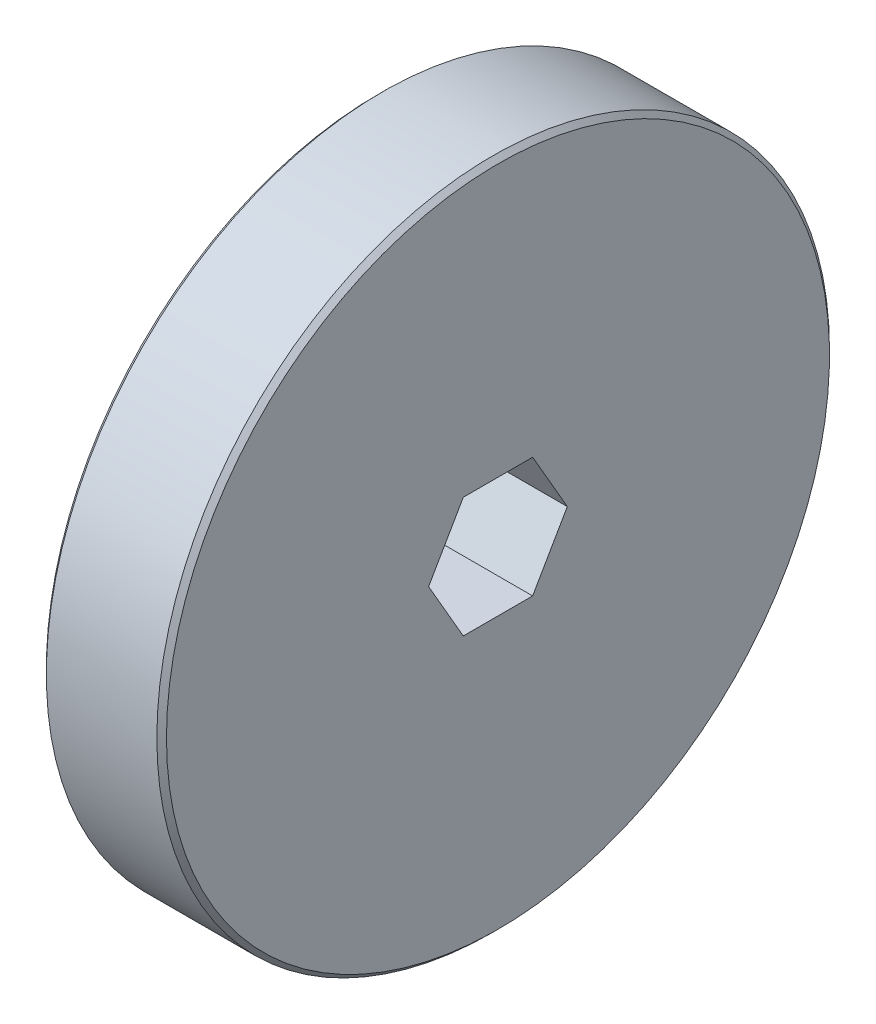
ISO-10303-21;
HEADER;
FILE_DESCRIPTION(('STEP AP214'),'2;1');
FILE_NAME('part.step','',(''),(''),'','','');
FILE_SCHEMA(('AUTOMOTIVE_DESIGN { 1 0 10303 214 1 1 1 1 }'));
ENDSEC;
DATA;
#1=APPLICATION_CONTEXT('core data for automotive mechanical design processes');
#2=APPLICATION_PROTOCOL_DEFINITION('international standard','automotive_design',2000,#1);
#3=PRODUCT_CONTEXT('',#1,'mechanical');
#4=PRODUCT('Part','Part','',(#3));
#5=PRODUCT_RELATED_PRODUCT_CATEGORY('part','',(#4));
#6=PRODUCT_DEFINITION_FORMATION('','',#4);
#7=PRODUCT_DEFINITION_CONTEXT('part definition',#1,'design');
#8=PRODUCT_DEFINITION('design','',#6,#7);
#9=PRODUCT_DEFINITION_SHAPE('','',#8);
#10=(LENGTH_UNIT() NAMED_UNIT(*) SI_UNIT(.MILLI.,.METRE.));
#11=(NAMED_UNIT(*) PLANE_ANGLE_UNIT() SI_UNIT($,.RADIAN.));
#12=(NAMED_UNIT(*) SI_UNIT($,.STERADIAN.) SOLID_ANGLE_UNIT());
#13=UNCERTAINTY_MEASURE_WITH_UNIT(LENGTH_MEASURE(1.E-05),#10,'distance_accuracy_value','');
#14=(GEOMETRIC_REPRESENTATION_CONTEXT(3) GLOBAL_UNCERTAINTY_ASSIGNED_CONTEXT((#13)) GLOBAL_UNIT_ASSIGNED_CONTEXT((#10,
#11,#12)) REPRESENTATION_CONTEXT('',''));
#15=CARTESIAN_POINT('',(0.,0.,0.));
#16=DIRECTION('',(0.,0.,1.));
#17=DIRECTION('',(1.,0.,0.));
#18=AXIS2_PLACEMENT_3D('',#15,#16,#17);
#19=CARTESIAN_POINT('',(837.258566213659,214.232644835281,0.));
#20=DIRECTION('',(1.,0.,0.));
#21=DIRECTION('',(0.,1.,0.));
#22=AXIS2_PLACEMENT_3D('',#19,#20,#21);
#23=TOROIDAL_SURFACE('',#22,8.19150000000003,0.253999999999916);
#24=CARTESIAN_POINT('',(837.512566213659,214.232644835281,0.));
#25=DIRECTION('',(1.,0.,0.));
#26=DIRECTION('',(0.,1.,0.));
#27=AXIS2_PLACEMENT_3D('',#24,#25,#26);
#28=CIRCLE('',#27,8.19149999999999);
#29=CARTESIAN_POINT('',(837.512566213659,222.424144835281,0.));
#30=VERTEX_POINT('',#29);
#31=EDGE_CURVE('E20',#30,#30,#28,.T.);
#32=ORIENTED_EDGE('',*,*,#31,.F.);
#33=EDGE_LOOP('',(#32));
#34=FACE_BOUND('',#33,.T.);
#35=CARTESIAN_POINT('',(837.258566213659,214.232644835281,0.));
#36=DIRECTION('',(1.,0.,0.));
#37=DIRECTION('',(0.,0.,-1.));
#38=AXIS2_PLACEMENT_3D('',#35,#36,#37);
#39=CIRCLE('',#38,7.9375);
#40=CARTESIAN_POINT('',(837.258566213659,214.232644835281,-7.9375));
#41=VERTEX_POINT('',#40);
#42=EDGE_CURVE('E156',#41,#41,#39,.F.);
#43=ORIENTED_EDGE('',*,*,#42,.F.);
#44=EDGE_LOOP('',(#43));
#45=FACE_BOUND('',#44,.T.);
#46=ADVANCED_FACE('F17',(#34,#45),#23,.F.);
#47=CARTESIAN_POINT('',(837.195066213659,214.232644835281,0.));
#48=DIRECTION('',(1.,0.,0.));
#49=DIRECTION('',(0.,0.,-1.));
#50=AXIS2_PLACEMENT_3D('',#47,#48,#49);
#51=CYLINDRICAL_SURFACE('',#50,7.9375);
#52=ORIENTED_EDGE('',*,*,#42,.T.);
#53=EDGE_LOOP('',(#52));
#54=FACE_BOUND('',#53,.T.);
#55=CARTESIAN_POINT('',(837.131566213773,214.232644835281,0.));
#56=DIRECTION('',(1.,0.,0.));
#57=DIRECTION('',(0.,-1.,0.));
#58=AXIS2_PLACEMENT_3D('',#55,#56,#57);
#59=CIRCLE('',#58,7.93749999988619);
#60=CARTESIAN_POINT('',(837.131566213773,206.295144835395,0.));
#61=VERTEX_POINT('',#60);
#62=EDGE_CURVE('E150',#61,#61,#59,.F.);
#63=ORIENTED_EDGE('',*,*,#62,.F.);
#64=EDGE_LOOP('',(#63));
#65=FACE_BOUND('',#64,.T.);
#66=ADVANCED_FACE('F335',(#54,#65),#51,.T.);
#67=CARTESIAN_POINT('',(837.512566213659,231.536394835281,0.));
#68=DIRECTION('',(-1.,0.,0.));
#69=DIRECTION('',(0.,0.,1.));
#70=AXIS2_PLACEMENT_3D('',#67,#68,#69);
#71=PLANE('',#70);
#72=ORIENTED_EDGE('',*,*,#31,.T.);
#73=EDGE_LOOP('',(#72));
#74=FACE_BOUND('',#73,.T.);
#75=CARTESIAN_POINT('',(837.512566213488,214.232644835281,0.));
#76=DIRECTION('',(1.,0.,0.));
#77=DIRECTION('',(0.,0.,-1.));
#78=AXIS2_PLACEMENT_3D('',#75,#76,#77);
#79=CIRCLE('',#78,26.289000000171);
#80=CARTESIAN_POINT('',(837.512566213488,214.232644835281,-26.289000000171));
#81=VERTEX_POINT('',#80);
#82=EDGE_CURVE('E153',#81,#81,#79,.T.);
#83=ORIENTED_EDGE('',*,*,#82,.F.);
#84=EDGE_LOOP('',(#83));
#85=FACE_BOUND('',#84,.T.);
#86=ADVANCED_FACE('F326',(#74,#85),#71,.T.);
#87=CARTESIAN_POINT('',(837.131566213773,214.232644835281,0.));
#88=DIRECTION('',(1.,0.,0.));
#89=DIRECTION('',(0.,0.,-1.));
#90=AXIS2_PLACEMENT_3D('',#87,#88,#89);
#91=CONICAL_SURFACE('',#90,7.93749999988616,0.785398162499982);
#92=ORIENTED_EDGE('',*,*,#62,.T.);
#93=EDGE_LOOP('',(#92));
#94=FACE_BOUND('',#93,.T.);
#95=CARTESIAN_POINT('',(836.877566213545,214.232644835281,0.));
#96=DIRECTION('',(1.,0.,0.));
#97=DIRECTION('',(0.,0.,-1.));
#98=AXIS2_PLACEMENT_3D('',#95,#96,#97);
#99=CIRCLE('',#98,7.68350000011406);
#100=CARTESIAN_POINT('',(836.877566213545,214.232644835281,-7.68350000011406));
#101=VERTEX_POINT('',#100);
#102=EDGE_CURVE('E147',#101,#101,#99,.F.);
#103=ORIENTED_EDGE('',*,*,#102,.F.);
#104=EDGE_LOOP('',(#103));
#105=FACE_BOUND('',#104,.T.);
#106=ADVANCED_FACE('F317',(#94,#105),#91,.T.);
#107=CARTESIAN_POINT('',(837.89356621383,214.232644835281,0.));
#108=DIRECTION('',(1.,0.,0.));
#109=DIRECTION('',(0.,0.,-1.));
#110=AXIS2_PLACEMENT_3D('',#107,#108,#109);
#111=CONICAL_SURFACE('',#110,26.6699999998291,0.785398162499945);
#112=CARTESIAN_POINT('',(837.893566213659,214.232644835281,0.));
#113=DIRECTION('',(1.,0.,0.));
#114=DIRECTION('',(0.,0.,-1.));
#115=AXIS2_PLACEMENT_3D('',#112,#113,#114);
#116=CIRCLE('',#115,26.67);
#117=CARTESIAN_POINT('',(837.893566213659,214.232644835281,-26.67));
#118=VERTEX_POINT('',#117);
#119=EDGE_CURVE('E144',#118,#118,#116,.T.);
#120=ORIENTED_EDGE('',*,*,#119,.F.);
#121=EDGE_LOOP('',(#120));
#122=FACE_BOUND('',#121,.T.);
#123=ORIENTED_EDGE('',*,*,#82,.T.);
#124=EDGE_LOOP('',(#123));
#125=FACE_BOUND('',#124,.T.);
#126=ADVANCED_FACE('F308',(#122,#125),#111,.T.);
#127=CARTESIAN_POINT('',(836.877566213659,218.201394835281,0.));
#128=DIRECTION('',(-1.,0.,0.));
#129=DIRECTION('',(0.,0.,1.));
#130=AXIS2_PLACEMENT_3D('',#127,#128,#129);
#131=PLANE('',#130);
#132=CARTESIAN_POINT('',(836.877566213218,214.232644835281,0.));
#133=DIRECTION('',(-1.,0.,0.));
#134=DIRECTION('',(0.,0.,1.));
#135=AXIS2_PLACEMENT_3D('',#132,#133,#134);
#136=CIRCLE('',#135,5.7784999995894);
#137=CARTESIAN_POINT('',(836.877566213218,214.232644835281,5.7784999995894));
#138=VERTEX_POINT('',#137);
#139=EDGE_CURVE('E116',#138,#138,#136,.F.);
#140=ORIENTED_EDGE('',*,*,#139,.T.);
#141=EDGE_LOOP('',(#140));
#142=FACE_BOUND('',#141,.T.);
#143=ORIENTED_EDGE('',*,*,#102,.T.);
#144=EDGE_LOOP('',(#143));
#145=FACE_BOUND('',#144,.T.);
#146=ADVANCED_FACE('F300',(#142,#145),#131,.T.);
#147=CARTESIAN_POINT('',(842.275066213659,214.232644835281,0.));
#148=DIRECTION('',(1.,0.,0.));
#149=DIRECTION('',(0.,0.,-1.));
#150=AXIS2_PLACEMENT_3D('',#147,#148,#149);
#151=CYLINDRICAL_SURFACE('',#150,26.67);
#152=CARTESIAN_POINT('',(846.656566213488,214.232644835281,0.));
#153=DIRECTION('',(-1.,0.,0.));
#154=DIRECTION('',(0.,-1.,0.));
#155=AXIS2_PLACEMENT_3D('',#152,#153,#154);
#156=CIRCLE('',#155,26.6699999998289);
#157=CARTESIAN_POINT('',(846.656566213488,187.562644835452,0.));
#158=VERTEX_POINT('',#157);
#159=EDGE_CURVE('E83',#158,#158,#156,.F.);
#160=ORIENTED_EDGE('',*,*,#159,.F.);
#161=EDGE_LOOP('',(#160));
#162=FACE_BOUND('',#161,.T.);
#163=ORIENTED_EDGE('',*,*,#119,.T.);
#164=EDGE_LOOP('',(#163));
#165=FACE_BOUND('',#164,.T.);
#166=ADVANCED_FACE('F222',(#162,#165),#151,.T.);
#167=CARTESIAN_POINT('',(836.877566213332,214.232644835281,0.));
#168=DIRECTION('',(-1.,0.,0.));
#169=DIRECTION('',(0.,0.,1.));
#170=AXIS2_PLACEMENT_3D('',#167,#168,#169);
#171=CONICAL_SURFACE('',#170,5.77849999947572,0.785398162479808);
#172=ORIENTED_EDGE('',*,*,#139,.F.);
#173=EDGE_LOOP('',(#172));
#174=FACE_BOUND('',#173,.T.);
#175=CARTESIAN_POINT('',(837.156804899375,214.23264483515,5.4992613140049));
#176=CARTESIAN_POINT('',(837.203764506173,214.151296721603,5.45229495871926));
#177=CARTESIAN_POINT('',(837.249292121181,214.069327036238,5.4049697387953));
#178=CARTESIAN_POINT('',(837.337051412476,213.904023698699,5.30953181235902));
#179=CARTESIAN_POINT('',(837.379281294079,213.820689333274,5.26141869405156));
#180=CARTESIAN_POINT('',(837.50078464314,213.567584214509,5.1152883856044));
#181=CARTESIAN_POINT('',(837.574297836866,213.395684363853,5.01604196055245));
#182=CARTESIAN_POINT('',(837.701197168666,213.046877274866,4.81465809382796));
#183=CARTESIAN_POINT('',(837.754651424902,212.869989217626,4.71253172636323));
#184=CARTESIAN_POINT('',(837.816446435017,212.601772060353,4.55767647841306));
#185=CARTESIAN_POINT('',(837.833970031529,212.511998147044,4.50584548539932));
#186=CARTESIAN_POINT('',(837.862490403619,212.331686866309,4.4017427189247));
#187=CARTESIAN_POINT('',(837.873489349348,212.241149762899,4.34947109789359));
#188=CARTESIAN_POINT('',(837.885222586719,212.100644053655,4.26835008885097));
#189=CARTESIAN_POINT('',(837.888349230901,212.050817576387,4.23958275879582));
#190=CARTESIAN_POINT('',(837.892521445237,211.951127913255,4.18202690492638));
#191=CARTESIAN_POINT('',(837.893568145892,211.901264762076,4.15323840113767));
#192=CARTESIAN_POINT('',(837.893561367614,211.726231122484,4.05218268214806));
#193=CARTESIAN_POINT('',(837.886951069542,211.601024729453,3.97989473749983));
#194=CARTESIAN_POINT('',(837.860872150104,211.351572110559,3.83587320088448));
#195=CARTESIAN_POINT('',(837.841394560357,211.227326615584,3.76414003089556));
#196=CARTESIAN_POINT('',(837.790496761624,210.980109402702,3.62140910647534));
#197=CARTESIAN_POINT('',(837.759021632719,210.857146254712,3.55041629988838));
#198=CARTESIAN_POINT('',(837.685567559506,210.613584185982,3.4097956739465));
#199=CARTESIAN_POINT('',(837.643584562668,210.492986196799,3.34016839242643));
#200=CARTESIAN_POINT('',(837.536481927183,210.217975457053,3.18139086780315));
#201=CARTESIAN_POINT('',(837.468212112531,210.064484316596,3.09277271654229));
#202=CARTESIAN_POINT('',(837.357151111582,209.838332372995,2.96220383102676));
#203=CARTESIAN_POINT('',(837.318880861494,209.763957313138,2.91926337019752));
#204=CARTESIAN_POINT('',(837.239725108844,209.616271808842,2.8339971045368));
#205=CARTESIAN_POINT('',(837.198840041688,209.542961189639,2.7916711988056));
#206=CARTESIAN_POINT('',(837.156804899355,209.470144835397,2.74963065708219));
#207=B_SPLINE_CURVE_WITH_KNOTS('',3,(#175,#176,#177,#178,#179,#180,#181,#182,#183,#184,#185,
#186,#187,#188,#189,#190,#191,#192,#193,#194,#195,#196,#197,#198,#199,#200,#201,#202,#203,#204,
#205,#206),.UNSPECIFIED.,.F.,.F.,(4,2,2,2,2,2,2,2,2,2,2,2,2,2,2,4),(0.,0.315033356543265,
0.630236981871507,1.26441953449715,1.89642854619521,2.21165534616572,2.52677724035208,
2.69960160991942,2.87233201940279,3.30585139208471,3.73967324288936,4.17550527968456,
4.61150566187489,5.18066674363257,5.46270108836043,5.74468859184734),.UNSPECIFIED.);
#208=CARTESIAN_POINT('',(837.156804899357,214.232644835281,5.4992613139633));
#209=VERTEX_POINT('',#208);
#210=CARTESIAN_POINT('',(837.156804899357,209.47014483534,2.74963065698166));
#211=VERTEX_POINT('',#210);
#212=EDGE_CURVE('E90',#209,#211,#207,.T.);
#213=ORIENTED_EDGE('',*,*,#212,.T.);
#214=CARTESIAN_POINT('',(837.156804899375,209.470144835239,2.74963065688916));
#215=CARTESIAN_POINT('',(837.203764506173,209.470144835266,2.65569794636446));
#216=CARTESIAN_POINT('',(837.249292121181,209.470144835277,2.56104750653634));
#217=CARTESIAN_POINT('',(837.337051412476,209.470144835286,2.37017165367875));
#218=CARTESIAN_POINT('',(837.379281294079,209.470144835283,2.273945417059));
#219=CARTESIAN_POINT('',(837.50078464314,209.470144835278,1.98168480015664));
#220=CARTESIAN_POINT('',(837.574297836866,209.47014483528,1.78319195005615));
#221=CARTESIAN_POINT('',(837.701197168666,209.470144835282,1.38042421661107));
#222=CARTESIAN_POINT('',(837.754651424902,209.470144835283,1.17617148168209));
#223=CARTESIAN_POINT('',(837.816446435017,209.470144835281,0.866460985778095));
#224=CARTESIAN_POINT('',(837.833970031529,209.470144835279,0.762798999748665));
#225=CARTESIAN_POINT('',(837.862490403619,209.470144835283,0.554593466805791));
#226=CARTESIAN_POINT('',(837.873489349348,209.470144835288,0.450050224751869));
#227=CARTESIAN_POINT('',(837.885222586719,209.470144835278,0.287808206648838));
#228=CARTESIAN_POINT('',(837.888349230901,209.470144835271,0.230273546526256));
#229=CARTESIAN_POINT('',(837.892521445237,209.470144835292,0.11516183882451));
#230=CARTESIAN_POINT('',(837.893568145892,209.47014483532,0.0575848312964613));
#231=CARTESIAN_POINT('',(837.893561367614,209.470144835367,-0.144526606602171));
#232=CARTESIAN_POINT('',(837.886951069542,209.470144835304,-0.289102496007333));
#233=CARTESIAN_POINT('',(837.860872150104,209.470144835258,-0.577145569317661));
#234=CARTESIAN_POINT('',(837.841394560357,209.470144835275,-0.720611909266349));
#235=CARTESIAN_POINT('',(837.790496761624,209.470144835287,-1.00607375808534));
#236=CARTESIAN_POINT('',(837.759021632719,209.470144835283,-1.14805937126713));
#237=CARTESIAN_POINT('',(837.685567559506,209.47014483528,-1.4293006231567));
#238=CARTESIAN_POINT('',(837.643584562668,209.470144835281,-1.56855518619481));
#239=CARTESIAN_POINT('',(837.536481927183,209.470144835282,-1.88611023543937));
#240=CARTESIAN_POINT('',(837.468212112531,209.470144835281,-2.06334653796198));
#241=CARTESIAN_POINT('',(837.357151111582,209.470144835281,-2.32448430899338));
#242=CARTESIAN_POINT('',(837.318880861494,209.470144835281,-2.41036523065183));
#243=CARTESIAN_POINT('',(837.239725108844,209.470144835281,-2.58089776197315));
#244=CARTESIAN_POINT('',(837.198840041688,209.470144835281,-2.6655495734355));
#245=CARTESIAN_POINT('',(837.156804899355,209.470144835281,-2.74963065688241));
#246=B_SPLINE_CURVE_WITH_KNOTS('',3,(#214,#215,#216,#217,#218,#219,#220,#221,#222,#223,#224,
#225,#226,#227,#228,#229,#230,#231,#232,#233,#234,#235,#236,#237,#238,#239,#240,#241,#242,#243,
#244,#245),.UNSPECIFIED.,.F.,.F.,(4,2,2,2,2,2,2,2,2,2,2,2,2,2,2,4),(0.,0.315033356543268,
0.630236981871517,1.26441953449716,1.89642854619521,2.21165534616574,2.52677724035209,
2.69960160991944,2.87233201940281,3.30585139208471,3.73967324288935,4.17550527968455,
4.6115056618749,5.18066674363258,5.46270108836044,5.74468859184735),.UNSPECIFIED.);
#247=CARTESIAN_POINT('',(837.156804899357,209.47014483534,-2.74963065698164));
#248=VERTEX_POINT('',#247);
#249=EDGE_CURVE('E102',#211,#248,#246,.T.);
#250=ORIENTED_EDGE('',*,*,#249,.T.);
#251=CARTESIAN_POINT('',(837.156804899375,209.470144835369,-2.74963065711573));
#252=CARTESIAN_POINT('',(837.203764506173,209.551492948944,-2.79659701235479));
#253=CARTESIAN_POINT('',(837.249292121181,209.63346263432,-2.84392223225896));
#254=CARTESIAN_POINT('',(837.337051412476,209.798765971868,-2.93936015868027));
#255=CARTESIAN_POINT('',(837.379281294079,209.88210033729,-2.98747327699256));
#256=CARTESIAN_POINT('',(837.50078464314,210.135205456051,-3.13360358544776));
#257=CARTESIAN_POINT('',(837.574297836866,210.307105306708,-3.2328500104963));
#258=CARTESIAN_POINT('',(837.701197168666,210.655912395697,-3.43423387721689));
#259=CARTESIAN_POINT('',(837.754651424902,210.832800452939,-3.53636024468113));
#260=CARTESIAN_POINT('',(837.816446435017,211.101017610209,-3.69121549263496));
#261=CARTESIAN_POINT('',(837.833970031529,211.190791523517,-3.74304648565065));
#262=CARTESIAN_POINT('',(837.862490403619,211.371102804256,-3.8471492521189));
#263=CARTESIAN_POINT('',(837.873489349348,211.461639907671,-3.89942087314171));
#264=CARTESIAN_POINT('',(837.885222586719,211.602145616904,-3.98054188220212));
#265=CARTESIAN_POINT('',(837.888349230901,211.651972094165,-4.00930921226954));
#266=CARTESIAN_POINT('',(837.892521445237,211.751661757318,-4.06686506610186));
#267=CARTESIAN_POINT('',(837.893568145892,211.801524908526,-4.09565356984121));
#268=CARTESIAN_POINT('',(837.893561367614,211.976558548164,-4.19670928875024));
#269=CARTESIAN_POINT('',(837.886951069542,212.101764941133,-4.26899723350717));
#270=CARTESIAN_POINT('',(837.860872150104,212.351217559981,-4.41301877020217));
#271=CARTESIAN_POINT('',(837.841394560357,212.475463054973,-4.48475194016194));
#272=CARTESIAN_POINT('',(837.790496761624,212.722680267867,-4.62748286456072));
#273=CARTESIAN_POINT('',(837.759021632719,212.845643415852,-4.69847567115553));
#274=CARTESIAN_POINT('',(837.685567559506,213.089205484579,-4.83909629710322));
#275=CARTESIAN_POINT('',(837.643584562668,213.209803473764,-4.90872357862125));
#276=CARTESIAN_POINT('',(837.536481927183,213.48481421351,-5.06750110324253));
#277=CARTESIAN_POINT('',(837.468212112531,213.638305353967,-5.15611925450427));
#278=CARTESIAN_POINT('',(837.357151111582,213.864457297568,-5.28668814002015));
#279=CARTESIAN_POINT('',(837.318880861494,213.938832357425,-5.32962860084935));
#280=CARTESIAN_POINT('',(837.239725108844,214.08651786172,-5.41489486650996));
#281=CARTESIAN_POINT('',(837.198840041688,214.159828480923,-5.4572207722411));
#282=CARTESIAN_POINT('',(837.156804899355,214.232644835166,-5.4992613139646));
#283=B_SPLINE_CURVE_WITH_KNOTS('',3,(#251,#252,#253,#254,#255,#256,#257,#258,#259,#260,#261,
#262,#263,#264,#265,#266,#267,#268,#269,#270,#271,#272,#273,#274,#275,#276,#277,#278,#279,#280,
#281,#282),.UNSPECIFIED.,.F.,.F.,(4,2,2,2,2,2,2,2,2,2,2,2,2,2,2,4),(0.,0.315033356543281,
0.630236981871528,1.26441953449719,1.89642854619526,2.21165534616574,2.5267772403521,
2.69960160991944,2.87233201940286,3.30585139208479,3.73967324288941,4.17550527968462,
4.61150566187497,5.1806667436326,5.46270108836049,5.74468859184737),.UNSPECIFIED.);
#284=CARTESIAN_POINT('',(837.156804899357,214.232644835281,-5.4992613139633));
#285=VERTEX_POINT('',#284);
#286=EDGE_CURVE('E107',#248,#285,#283,.T.);
#287=ORIENTED_EDGE('',*,*,#286,.T.);
#288=CARTESIAN_POINT('',(837.156804899375,214.232644835412,-5.4992613140049));
#289=CARTESIAN_POINT('',(837.203764506173,214.313992948959,-5.45229495871926));
#290=CARTESIAN_POINT('',(837.249292121181,214.395962634324,-5.40496973879529));
#291=CARTESIAN_POINT('',(837.337051412476,214.561265971864,-5.30953181235901));
#292=CARTESIAN_POINT('',(837.379281294079,214.644600337288,-5.26141869405156));
#293=CARTESIAN_POINT('',(837.50078464314,214.897705456054,-5.11528838560439));
#294=CARTESIAN_POINT('',(837.574297836866,215.069605306709,-5.01604196055244));
#295=CARTESIAN_POINT('',(837.701197168666,215.418412395696,-4.81465809382795));
#296=CARTESIAN_POINT('',(837.754651424902,215.595300452937,-4.71253172636322));
#297=CARTESIAN_POINT('',(837.816446435017,215.86351761021,-4.55767647841306));
#298=CARTESIAN_POINT('',(837.833970031529,215.953291523519,-4.50584548539932));
#299=CARTESIAN_POINT('',(837.862490403619,216.133602804254,-4.4017427189247));
#300=CARTESIAN_POINT('',(837.873489349348,216.224139907664,-4.34947109789359));
#301=CARTESIAN_POINT('',(837.885222586719,216.364645616908,-4.26835008885097));
#302=CARTESIAN_POINT('',(837.888349230901,216.414472094175,-4.23958275879582));
#303=CARTESIAN_POINT('',(837.892521445237,216.514161757307,-4.18202690492638));
#304=CARTESIAN_POINT('',(837.893568145892,216.564024908486,-4.15323840113767));
#305=CARTESIAN_POINT('',(837.893561367614,216.739058548079,-4.05218268214807));
#306=CARTESIAN_POINT('',(837.886951069542,216.86426494111,-3.97989473749981));
#307=CARTESIAN_POINT('',(837.860872150104,217.113717560004,-3.83587320088445));
#308=CARTESIAN_POINT('',(837.841394560357,217.237963054979,-3.76414003089553));
#309=CARTESIAN_POINT('',(837.790496761624,217.485180267861,-3.62140910647532));
#310=CARTESIAN_POINT('',(837.759021632719,217.608143415851,-3.55041629988836));
#311=CARTESIAN_POINT('',(837.685567559506,217.851705484581,-3.40979567394648));
#312=CARTESIAN_POINT('',(837.643584562668,217.972303473764,-3.3401683924264));
#313=CARTESIAN_POINT('',(837.536481927183,218.247314213509,-3.18139086780314));
#314=CARTESIAN_POINT('',(837.468212112531,218.400805353967,-3.09277271654229));
#315=CARTESIAN_POINT('',(837.357151111582,218.626957297568,-2.96220383102674));
#316=CARTESIAN_POINT('',(837.318880861494,218.701332357425,-2.91926337019748));
#317=CARTESIAN_POINT('',(837.239725108844,218.84901786172,-2.83399710453676));
#318=CARTESIAN_POINT('',(837.198840041688,218.922328480923,-2.79167119880556));
#319=CARTESIAN_POINT('',(837.156804899355,218.995144835166,-2.74963065708218));
#320=B_SPLINE_CURVE_WITH_KNOTS('',3,(#288,#289,#290,#291,#292,#293,#294,#295,#296,#297,#298,
#299,#300,#301,#302,#303,#304,#305,#306,#307,#308,#309,#310,#311,#312,#313,#314,#315,#316,#317,
#318,#319),.UNSPECIFIED.,.F.,.F.,(4,2,2,2,2,2,2,2,2,2,2,2,2,2,2,4),(0.,0.315033356543317,
0.630236981871506,1.26441953449717,1.89642854619521,2.21165534616572,2.52677724035208,
2.69960160991942,2.87233201940284,3.30585139208477,3.73967324288942,4.17550527968459,
4.61150566187495,5.1806667436326,5.4627010883605,5.74468859184738),.UNSPECIFIED.);
#321=CARTESIAN_POINT('',(837.156804899357,218.995144835223,-2.74963065698164));
#322=VERTEX_POINT('',#321);
#323=EDGE_CURVE('E80',#285,#322,#320,.T.);
#324=ORIENTED_EDGE('',*,*,#323,.T.);
#325=CARTESIAN_POINT('',(837.156804899375,218.995144835324,-2.74963065688917));
#326=CARTESIAN_POINT('',(837.203764506173,218.995144835297,-2.65569794636447));
#327=CARTESIAN_POINT('',(837.249292121181,218.995144835286,-2.56104750653635));
#328=CARTESIAN_POINT('',(837.337051412476,218.995144835277,-2.37017165367876));
#329=CARTESIAN_POINT('',(837.379281294079,218.99514483528,-2.27394541705901));
#330=CARTESIAN_POINT('',(837.50078464314,218.995144835284,-1.98168480015664));
#331=CARTESIAN_POINT('',(837.574297836866,218.995144835282,-1.78319195005615));
#332=CARTESIAN_POINT('',(837.701197168666,218.99514483528,-1.38042421661107));
#333=CARTESIAN_POINT('',(837.754651424902,218.99514483528,-1.17617148168208));
#334=CARTESIAN_POINT('',(837.816446435017,218.995144835282,-0.866460985778083));
#335=CARTESIAN_POINT('',(837.833970031529,218.995144835283,-0.762798999748651));
#336=CARTESIAN_POINT('',(837.862490403619,218.995144835279,-0.554593466805774));
#337=CARTESIAN_POINT('',(837.873489349348,218.995144835275,-0.45005022475185));
#338=CARTESIAN_POINT('',(837.885222586719,218.995144835285,-0.287808206648822));
#339=CARTESIAN_POINT('',(837.888349230901,218.995144835292,-0.230273546526244));
#340=CARTESIAN_POINT('',(837.892521445237,218.995144835271,-0.115161838824506));
#341=CARTESIAN_POINT('',(837.893568145892,218.995144835242,-0.0575848312964615));
#342=CARTESIAN_POINT('',(837.893561367614,218.995144835196,0.14452660660217));
#343=CARTESIAN_POINT('',(837.886951069542,218.995144835258,0.289102496007335));
#344=CARTESIAN_POINT('',(837.860872150104,218.995144835304,0.577145569317669));
#345=CARTESIAN_POINT('',(837.841394560357,218.995144835288,0.72061190926636));
#346=CARTESIAN_POINT('',(837.790496761624,218.995144835275,1.00607375808535));
#347=CARTESIAN_POINT('',(837.759021632719,218.99514483528,1.14805937126714));
#348=CARTESIAN_POINT('',(837.685567559506,218.995144835283,1.4293006231567));
#349=CARTESIAN_POINT('',(837.643584562668,218.995144835282,1.5685551861948));
#350=CARTESIAN_POINT('',(837.536481927183,218.995144835281,1.88611023543936));
#351=CARTESIAN_POINT('',(837.468212112531,218.995144835281,2.06334653796197));
#352=CARTESIAN_POINT('',(837.357151111582,218.995144835281,2.32448430899338));
#353=CARTESIAN_POINT('',(837.318880861494,218.995144835281,2.41036523065183));
#354=CARTESIAN_POINT('',(837.239725108844,218.995144835281,2.58089776197315));
#355=CARTESIAN_POINT('',(837.198840041688,218.995144835281,2.66554957343551));
#356=CARTESIAN_POINT('',(837.156804899355,218.995144835281,2.74963065688242));
#357=B_SPLINE_CURVE_WITH_KNOTS('',3,(#325,#326,#327,#328,#329,#330,#331,#332,#333,#334,#335,
#336,#337,#338,#339,#340,#341,#342,#343,#344,#345,#346,#347,#348,#349,#350,#351,#352,#353,#354,
#355,#356),.UNSPECIFIED.,.F.,.F.,(4,2,2,2,2,2,2,2,2,2,2,2,2,2,2,4),(0.,0.315033356543275,
0.630236981871527,1.26441953449718,1.89642854619524,2.21165534616577,2.52677724035213,
2.69960160991946,2.87233201940282,3.30585139208473,3.73967324288938,4.17550527968457,
4.61150566187491,5.18066674363259,5.46270108836045,5.74468859184737),.UNSPECIFIED.);
#358=CARTESIAN_POINT('',(837.156804899323,218.995144835281,2.74963065694771));
#359=VERTEX_POINT('',#358);
#360=EDGE_CURVE('E77',#322,#359,#357,.T.);
#361=ORIENTED_EDGE('',*,*,#360,.T.);
#362=CARTESIAN_POINT('',(837.156804899375,218.995144835193,2.74963065711574));
#363=CARTESIAN_POINT('',(837.203764506173,218.913796721619,2.7965970123548));
#364=CARTESIAN_POINT('',(837.249292121181,218.831827036243,2.84392223225896));
#365=CARTESIAN_POINT('',(837.337051412476,218.666523698695,2.93936015868026));
#366=CARTESIAN_POINT('',(837.379281294079,218.583189333273,2.98747327699256));
#367=CARTESIAN_POINT('',(837.50078464314,218.330084214512,3.13360358544776));
#368=CARTESIAN_POINT('',(837.574297836866,218.158184363854,3.23285001049631));
#369=CARTESIAN_POINT('',(837.701197168666,217.809377274865,3.4342338772169));
#370=CARTESIAN_POINT('',(837.754651424902,217.632489217624,3.53636024468114));
#371=CARTESIAN_POINT('',(837.816446435017,217.364272060354,3.69121549263498));
#372=CARTESIAN_POINT('',(837.833970031529,217.274498147046,3.74304648565068));
#373=CARTESIAN_POINT('',(837.862490403619,217.094186866307,3.84714925211894));
#374=CARTESIAN_POINT('',(837.873489349348,217.003649762892,3.89942087314174));
#375=CARTESIAN_POINT('',(837.885222586719,216.863144053659,3.98054188220215));
#376=CARTESIAN_POINT('',(837.888349230901,216.813317576398,4.00930921226956));
#377=CARTESIAN_POINT('',(837.892521445237,216.713627913245,4.06686506610186));
#378=CARTESIAN_POINT('',(837.893568145892,216.663764762037,4.09565356984121));
#379=CARTESIAN_POINT('',(837.893561367614,216.488731122398,4.19670928875025));
#380=CARTESIAN_POINT('',(837.886951069542,216.36352472943,4.26899723350716));
#381=CARTESIAN_POINT('',(837.860872150104,216.114072110582,4.41301877020214));
#382=CARTESIAN_POINT('',(837.841394560357,215.98982661559,4.48475194016193));
#383=CARTESIAN_POINT('',(837.790496761624,215.742609402695,4.62748286456071));
#384=CARTESIAN_POINT('',(837.759021632719,215.61964625471,4.69847567115553));
#385=CARTESIAN_POINT('',(837.685567559506,215.376084185984,4.83909629710321));
#386=CARTESIAN_POINT('',(837.643584562668,215.255486196799,4.90872357862123));
#387=CARTESIAN_POINT('',(837.536481927183,214.980475457053,5.06750110324252));
#388=CARTESIAN_POINT('',(837.468212112531,214.826984316596,5.15611925450427));
#389=CARTESIAN_POINT('',(837.357151111582,214.600832372995,5.28668814002014));
#390=CARTESIAN_POINT('',(837.318880861494,214.526457313138,5.32962860084933));
#391=CARTESIAN_POINT('',(837.239725108844,214.378771808842,5.41489486650994));
#392=CARTESIAN_POINT('',(837.198840041688,214.305461189639,5.45722077224109));
#393=CARTESIAN_POINT('',(837.156804899355,214.232644835397,5.4992613139646));
#394=B_SPLINE_CURVE_WITH_KNOTS('',3,(#362,#363,#364,#365,#366,#367,#368,#369,#370,#371,#372,
#373,#374,#375,#376,#377,#378,#379,#380,#381,#382,#383,#384,#385,#386,#387,#388,#389,#390,#391,
#392,#393),.UNSPECIFIED.,.F.,.F.,(4,2,2,2,2,2,2,2,2,2,2,2,2,2,2,4),(0.,0.315033356543274,
0.630236981871547,1.26441953449722,1.89642854619531,2.21165534616582,2.52677724035218,
2.69960160991949,2.87233201940283,3.30585139208475,3.7396732428894,4.17550527968466,
4.61150566187493,5.18066674363261,5.46270108836047,5.74468859184738),.UNSPECIFIED.);
#395=EDGE_CURVE('E67',#359,#209,#394,.T.);
#396=ORIENTED_EDGE('',*,*,#395,.T.);
#397=EDGE_LOOP('',(#213,#250,#287,#324,#361,#396));
#398=FACE_BOUND('',#397,.T.);
#399=ADVANCED_FACE('F78',(#174,#398),#171,.F.);
#400=CARTESIAN_POINT('',(846.656566213488,214.232644835281,0.));
#401=DIRECTION('',(-1.,0.,0.));
#402=DIRECTION('',(0.,0.,1.));
#403=AXIS2_PLACEMENT_3D('',#400,#401,#402);
#404=CONICAL_SURFACE('',#403,26.6699999998289,0.785398162499982);
#405=CARTESIAN_POINT('',(847.03756621383,214.232644835281,0.));
#406=DIRECTION('',(-1.,0.,0.));
#407=DIRECTION('',(0.,0.,1.));
#408=AXIS2_PLACEMENT_3D('',#405,#406,#407);
#409=CIRCLE('',#408,26.2890000001709);
#410=CARTESIAN_POINT('',(847.03756621383,214.232644835281,26.2890000001709));
#411=VERTEX_POINT('',#410);
#412=EDGE_CURVE('E128',#411,#411,#409,.F.);
#413=ORIENTED_EDGE('',*,*,#412,.F.);
#414=EDGE_LOOP('',(#413));
#415=FACE_BOUND('',#414,.T.);
#416=ORIENTED_EDGE('',*,*,#159,.T.);
#417=EDGE_LOOP('',(#416));
#418=FACE_BOUND('',#417,.T.);
#419=ADVANCED_FACE('F215',(#415,#418),#404,.T.);
#420=CARTESIAN_POINT('',(836.877566213659,218.995144835281,2.7496306570156));
#421=DIRECTION('',(0.,1.,0.));
#422=DIRECTION('',(0.,0.,1.));
#423=AXIS2_PLACEMENT_3D('',#420,#421,#422);
#424=PLANE('',#423);
#425=DIRECTION('',(1.,0.,0.));
#426=VECTOR('',#425,1.);
#427=CARTESIAN_POINT('',(836.877566213659,218.995144835281,2.7496306570156));
#428=LINE('',#427,#426);
#429=CARTESIAN_POINT('',(847.037566213659,218.995144835281,2.7496306570156));
#430=VERTEX_POINT('',#429);
#431=EDGE_CURVE('E71',#430,#359,#428,.F.);
#432=ORIENTED_EDGE('',*,*,#431,.T.);
#433=ORIENTED_EDGE('',*,*,#360,.F.);
#434=DIRECTION('',(1.,0.,0.));
#435=VECTOR('',#434,1.);
#436=CARTESIAN_POINT('',(836.877566213659,218.995144835281,-2.7496306570156));
#437=LINE('',#436,#435);
#438=CARTESIAN_POINT('',(847.037566213659,218.995144835281,-2.7496306570156));
#439=VERTEX_POINT('',#438);
#440=EDGE_CURVE('E110',#322,#439,#437,.T.);
#441=ORIENTED_EDGE('',*,*,#440,.T.);
#442=DIRECTION('',(0.,0.,-1.));
#443=VECTOR('',#442,1.);
#444=CARTESIAN_POINT('',(847.037566213659,218.995144835281,0.));
#445=LINE('',#444,#443);
#446=EDGE_CURVE('E87',#430,#439,#445,.T.);
#447=ORIENTED_EDGE('',*,*,#446,.F.);
#448=EDGE_LOOP('',(#432,#433,#441,#447));
#449=FACE_BOUND('',#448,.T.);
#450=ADVANCED_FACE('F85',(#449),#424,.F.);
#451=CARTESIAN_POINT('',(836.877566213659,218.995144835281,-2.7496306570156));
#452=DIRECTION('',(0.,0.5,-0.866025403784439));
#453=DIRECTION('',(0.,0.866025403784439,0.5));
#454=AXIS2_PLACEMENT_3D('',#451,#452,#453);
#455=PLANE('',#454);
#456=ORIENTED_EDGE('',*,*,#440,.F.);
#457=ORIENTED_EDGE('',*,*,#323,.F.);
#458=DIRECTION('',(1.,0.,0.));
#459=VECTOR('',#458,1.);
#460=CARTESIAN_POINT('',(836.877566213659,214.232644835281,-5.49926131403119));
#461=LINE('',#460,#459);
#462=CARTESIAN_POINT('',(847.037566213659,214.232644835281,-5.49926131403119));
#463=VERTEX_POINT('',#462);
#464=EDGE_CURVE('E105',#285,#463,#461,.T.);
#465=ORIENTED_EDGE('',*,*,#464,.T.);
#466=DIRECTION('',(0.,-0.866025403784438,-0.5));
#467=VECTOR('',#466,1.);
#468=CARTESIAN_POINT('',(847.037566213659,218.995144835281,-2.7496306570156));
#469=LINE('',#468,#467);
#470=EDGE_CURVE('E127',#439,#463,#469,.T.);
#471=ORIENTED_EDGE('',*,*,#470,.F.);
#472=EDGE_LOOP('',(#456,#457,#465,#471));
#473=FACE_BOUND('',#472,.T.);
#474=ADVANCED_FACE('F209',(#473),#455,.F.);
#475=CARTESIAN_POINT('',(836.877566213659,214.232644835281,-5.49926131403119));
#476=DIRECTION('',(0.,-0.5,-0.866025403784438));
#477=DIRECTION('',(0.,0.866025403784438,-0.5));
#478=AXIS2_PLACEMENT_3D('',#475,#476,#477);
#479=PLANE('',#478);
#480=ORIENTED_EDGE('',*,*,#464,.F.);
#481=ORIENTED_EDGE('',*,*,#286,.F.);
#482=DIRECTION('',(1.,0.,0.));
#483=VECTOR('',#482,1.);
#484=CARTESIAN_POINT('',(836.877566213659,209.470144835281,-2.74963065701557));
#485=LINE('',#484,#483);
#486=CARTESIAN_POINT('',(847.037566213659,209.470144835281,-2.74963065701558));
#487=VERTEX_POINT('',#486);
#488=EDGE_CURVE('E100',#248,#487,#485,.T.);
#489=ORIENTED_EDGE('',*,*,#488,.T.);
#490=DIRECTION('',(0.,-0.866025403784438,0.5));
#491=VECTOR('',#490,1.);
#492=CARTESIAN_POINT('',(847.037566213659,214.232644835281,-5.49926131403119));
#493=LINE('',#492,#491);
#494=EDGE_CURVE('E133',#463,#487,#493,.T.);
#495=ORIENTED_EDGE('',*,*,#494,.F.);
#496=EDGE_LOOP('',(#480,#481,#489,#495));
#497=FACE_BOUND('',#496,.T.);
#498=ADVANCED_FACE('F188',(#497),#479,.F.);
#499=CARTESIAN_POINT('',(836.877566213659,209.470144835281,-2.7496306570156));
#500=DIRECTION('',(0.,-1.,0.));
#501=DIRECTION('',(0.,0.,-1.));
#502=AXIS2_PLACEMENT_3D('',#499,#500,#501);
#503=PLANE('',#502);
#504=ORIENTED_EDGE('',*,*,#488,.F.);
#505=ORIENTED_EDGE('',*,*,#249,.F.);
#506=DIRECTION('',(1.,0.,0.));
#507=VECTOR('',#506,1.);
#508=CARTESIAN_POINT('',(836.877566213659,209.470144835281,2.7496306570156));
#509=LINE('',#508,#507);
#510=CARTESIAN_POINT('',(847.037566213659,209.470144835281,2.7496306570156));
#511=VERTEX_POINT('',#510);
#512=EDGE_CURVE('E88',#211,#511,#509,.T.);
#513=ORIENTED_EDGE('',*,*,#512,.T.);
#514=DIRECTION('',(0.,0.,-1.));
#515=VECTOR('',#514,1.);
#516=CARTESIAN_POINT('',(847.037566213659,209.470144835281,0.));
#517=LINE('',#516,#515);
#518=EDGE_CURVE('E123',#487,#511,#517,.F.);
#519=ORIENTED_EDGE('',*,*,#518,.F.);
#520=EDGE_LOOP('',(#504,#505,#513,#519));
#521=FACE_BOUND('',#520,.T.);
#522=ADVANCED_FACE('F184',(#521),#503,.F.);
#523=CARTESIAN_POINT('',(836.877566213659,209.470144835281,2.7496306570156));
#524=DIRECTION('',(0.,-0.5,0.866025403784439));
#525=DIRECTION('',(0.,-0.866025403784439,-0.5));
#526=AXIS2_PLACEMENT_3D('',#523,#524,#525);
#527=PLANE('',#526);
#528=ORIENTED_EDGE('',*,*,#512,.F.);
#529=ORIENTED_EDGE('',*,*,#212,.F.);
#530=DIRECTION('',(1.,0.,0.));
#531=VECTOR('',#530,1.);
#532=CARTESIAN_POINT('',(836.877566213659,214.232644835281,5.49926131403119));
#533=LINE('',#532,#531);
#534=CARTESIAN_POINT('',(847.037566213659,214.232644835281,5.49926131403119));
#535=VERTEX_POINT('',#534);
#536=EDGE_CURVE('E35',#209,#535,#533,.T.);
#537=ORIENTED_EDGE('',*,*,#536,.T.);
#538=DIRECTION('',(0.,0.866025403784438,0.5));
#539=VECTOR('',#538,1.);
#540=CARTESIAN_POINT('',(847.037566213659,209.470144835281,2.7496306570156));
#541=LINE('',#540,#539);
#542=EDGE_CURVE('E26',#511,#535,#541,.T.);
#543=ORIENTED_EDGE('',*,*,#542,.F.);
#544=EDGE_LOOP('',(#528,#529,#537,#543));
#545=FACE_BOUND('',#544,.T.);
#546=ADVANCED_FACE('F180',(#545),#527,.F.);
#547=CARTESIAN_POINT('',(836.877566213659,214.232644835281,5.49926131403119));
#548=DIRECTION('',(0.,0.5,0.866025403784439));
#549=DIRECTION('',(0.,-0.866025403784439,0.5));
#550=AXIS2_PLACEMENT_3D('',#547,#548,#549);
#551=PLANE('',#550);
#552=ORIENTED_EDGE('',*,*,#536,.F.);
#553=ORIENTED_EDGE('',*,*,#395,.F.);
#554=ORIENTED_EDGE('',*,*,#431,.F.);
#555=DIRECTION('',(0.,0.866025403784438,-0.5));
#556=VECTOR('',#555,1.);
#557=CARTESIAN_POINT('',(847.037566213659,214.232644835281,5.49926131403119));
#558=LINE('',#557,#556);
#559=EDGE_CURVE('E11',#535,#430,#558,.T.);
#560=ORIENTED_EDGE('',*,*,#559,.F.);
#561=EDGE_LOOP('',(#552,#553,#554,#560));
#562=FACE_BOUND('',#561,.T.);
#563=ADVANCED_FACE('F69',(#562),#551,.F.);
#564=CARTESIAN_POINT('',(847.037566213659,227.567644835281,0.));
#565=DIRECTION('',(1.,0.,0.));
#566=DIRECTION('',(0.,0.,-1.));
#567=AXIS2_PLACEMENT_3D('',#564,#565,#566);
#568=PLANE('',#567);
#569=ORIENTED_EDGE('',*,*,#542,.T.);
#570=ORIENTED_EDGE('',*,*,#559,.T.);
#571=ORIENTED_EDGE('',*,*,#446,.T.);
#572=ORIENTED_EDGE('',*,*,#470,.T.);
#573=ORIENTED_EDGE('',*,*,#494,.T.);
#574=ORIENTED_EDGE('',*,*,#518,.T.);
#575=EDGE_LOOP('',(#569,#570,#571,#572,#573,#574));
#576=FACE_BOUND('',#575,.T.);
#577=ORIENTED_EDGE('',*,*,#412,.T.);
#578=EDGE_LOOP('',(#577));
#579=FACE_BOUND('',#578,.T.);
#580=ADVANCED_FACE('F179',(#576,#579),#568,.T.);
#581=CLOSED_SHELL('',(#46,#66,#86,#106,#126,#146,#166,#399,#419,#450,#474,#498,#522,#546,#563,#580));
#582=MANIFOLD_SOLID_BREP('B1',#581);
#583=ADVANCED_BREP_SHAPE_REPRESENTATION('',(#18,#582),#14);
#584=SHAPE_DEFINITION_REPRESENTATION(#9,#583);
ENDSEC;
END-ISO-10303-21;
